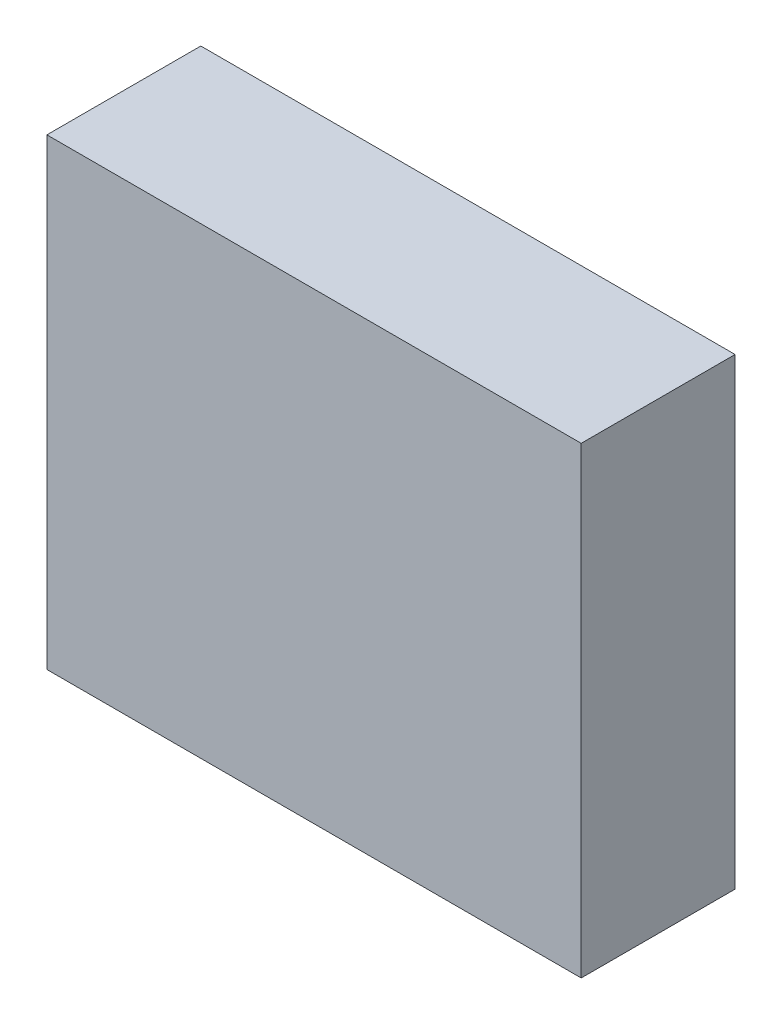
ISO-10303-21;
HEADER;
FILE_DESCRIPTION(('STEP AP214'),'2;1');
FILE_NAME('part.step','',(''),(''),'','','');
FILE_SCHEMA(('AUTOMOTIVE_DESIGN { 1 0 10303 214 1 1 1 1 }'));
ENDSEC;
DATA;
#1=APPLICATION_CONTEXT('core data for automotive mechanical design processes');
#2=APPLICATION_PROTOCOL_DEFINITION('international standard','automotive_design',2000,#1);
#3=PRODUCT_CONTEXT('',#1,'mechanical');
#4=PRODUCT('Part','Part','',(#3));
#5=PRODUCT_RELATED_PRODUCT_CATEGORY('part','',(#4));
#6=PRODUCT_DEFINITION_FORMATION('','',#4);
#7=PRODUCT_DEFINITION_CONTEXT('part definition',#1,'design');
#8=PRODUCT_DEFINITION('design','',#6,#7);
#9=PRODUCT_DEFINITION_SHAPE('','',#8);
#10=(LENGTH_UNIT() NAMED_UNIT(*) SI_UNIT(.MILLI.,.METRE.));
#11=(NAMED_UNIT(*) PLANE_ANGLE_UNIT() SI_UNIT($,.RADIAN.));
#12=(NAMED_UNIT(*) SI_UNIT($,.STERADIAN.) SOLID_ANGLE_UNIT());
#13=UNCERTAINTY_MEASURE_WITH_UNIT(LENGTH_MEASURE(1.E-05),#10,'distance_accuracy_value','');
#14=(GEOMETRIC_REPRESENTATION_CONTEXT(3) GLOBAL_UNCERTAINTY_ASSIGNED_CONTEXT((#13)) GLOBAL_UNIT_ASSIGNED_CONTEXT((#10,
#11,#12)) REPRESENTATION_CONTEXT('',''));
#15=CARTESIAN_POINT('',(0.,0.,0.));
#16=DIRECTION('',(0.,0.,1.));
#17=DIRECTION('',(1.,0.,0.));
#18=AXIS2_PLACEMENT_3D('',#15,#16,#17);
#19=CARTESIAN_POINT('',(-3.75000012,3.25000112,2.16000076));
#20=DIRECTION('',(0.,0.,1.));
#21=DIRECTION('',(1.,0.,0.));
#22=AXIS2_PLACEMENT_3D('',#19,#20,#21);
#23=PLANE('',#22);
#24=DIRECTION('',(0.,1.,0.));
#25=VECTOR('',#24,1.);
#26=CARTESIAN_POINT('',(3.75000012,3.25000112,2.16000076));
#27=LINE('',#26,#25);
#28=CARTESIAN_POINT('',(3.75000012,3.25000112,2.16000076));
#29=VERTEX_POINT('',#28);
#30=CARTESIAN_POINT('',(3.75000012,-3.25000112,2.16000076));
#31=VERTEX_POINT('',#30);
#32=EDGE_CURVE('E53',#29,#31,#27,.F.);
#33=ORIENTED_EDGE('',*,*,#32,.F.);
#34=DIRECTION('',(1.,0.,0.));
#35=VECTOR('',#34,1.);
#36=CARTESIAN_POINT('',(-3.75000012,3.25000112,2.16000076));
#37=LINE('',#36,#35);
#38=CARTESIAN_POINT('',(-3.75000012,3.25000112,2.16000076));
#39=VERTEX_POINT('',#38);
#40=EDGE_CURVE('E68',#39,#29,#37,.T.);
#41=ORIENTED_EDGE('',*,*,#40,.F.);
#42=DIRECTION('',(0.,1.,0.));
#43=VECTOR('',#42,1.);
#44=CARTESIAN_POINT('',(-3.75000012,-3.25000112,2.16000076));
#45=LINE('',#44,#43);
#46=CARTESIAN_POINT('',(-3.75000012,-3.25000112,2.16000076));
#47=VERTEX_POINT('',#46);
#48=EDGE_CURVE('E20',#47,#39,#45,.T.);
#49=ORIENTED_EDGE('',*,*,#48,.F.);
#50=DIRECTION('',(1.,0.,0.));
#51=VECTOR('',#50,1.);
#52=CARTESIAN_POINT('',(3.75000012,-3.25000112,2.16000076));
#53=LINE('',#52,#51);
#54=EDGE_CURVE('E58',#31,#47,#53,.F.);
#55=ORIENTED_EDGE('',*,*,#54,.F.);
#56=EDGE_LOOP('',(#33,#41,#49,#55));
#57=FACE_BOUND('',#56,.T.);
#58=ADVANCED_FACE('F17',(#57),#23,.T.);
#59=CARTESIAN_POINT('',(-3.75000012,-3.25000112,0.));
#60=DIRECTION('',(-1.,0.,0.));
#61=DIRECTION('',(0.,0.,1.));
#62=AXIS2_PLACEMENT_3D('',#59,#60,#61);
#63=PLANE('',#62);
#64=DIRECTION('',(0.,0.,1.));
#65=VECTOR('',#64,1.);
#66=CARTESIAN_POINT('',(-3.75000012,3.25000112,0.));
#67=LINE('',#66,#65);
#68=CARTESIAN_POINT('',(-3.75000012,3.25000112,0.));
#69=VERTEX_POINT('',#68);
#70=EDGE_CURVE('E79',#69,#39,#67,.T.);
#71=ORIENTED_EDGE('',*,*,#70,.F.);
#72=DIRECTION('',(0.,1.,0.));
#73=VECTOR('',#72,1.);
#74=CARTESIAN_POINT('',(-3.75000012,3.25000112,0.));
#75=LINE('',#74,#73);
#76=CARTESIAN_POINT('',(-3.75000012,-3.25000112,0.));
#77=VERTEX_POINT('',#76);
#78=EDGE_CURVE('E74',#69,#77,#75,.F.);
#79=ORIENTED_EDGE('',*,*,#78,.T.);
#80=DIRECTION('',(0.,0.,-1.));
#81=VECTOR('',#80,1.);
#82=CARTESIAN_POINT('',(-3.75000012,-3.25000112,0.));
#83=LINE('',#82,#81);
#84=EDGE_CURVE('E63',#47,#77,#83,.T.);
#85=ORIENTED_EDGE('',*,*,#84,.F.);
#86=ORIENTED_EDGE('',*,*,#48,.T.);
#87=EDGE_LOOP('',(#71,#79,#85,#86));
#88=FACE_BOUND('',#87,.T.);
#89=ADVANCED_FACE('F73',(#88),#63,.T.);
#90=CARTESIAN_POINT('',(3.75000012,-3.25000112,0.));
#91=DIRECTION('',(0.,-1.,0.));
#92=DIRECTION('',(0.,0.,-1.));
#93=AXIS2_PLACEMENT_3D('',#90,#91,#92);
#94=PLANE('',#93);
#95=ORIENTED_EDGE('',*,*,#84,.T.);
#96=DIRECTION('',(1.,0.,0.));
#97=VECTOR('',#96,1.);
#98=CARTESIAN_POINT('',(-3.75000012,-3.25000112,0.));
#99=LINE('',#98,#97);
#100=CARTESIAN_POINT('',(3.75000012,-3.25000112,0.));
#101=VERTEX_POINT('',#100);
#102=EDGE_CURVE('E84',#77,#101,#99,.T.);
#103=ORIENTED_EDGE('',*,*,#102,.T.);
#104=DIRECTION('',(0.,0.,-1.));
#105=VECTOR('',#104,1.);
#106=CARTESIAN_POINT('',(3.75000012,-3.25000112,0.));
#107=LINE('',#106,#105);
#108=EDGE_CURVE('E65',#31,#101,#107,.T.);
#109=ORIENTED_EDGE('',*,*,#108,.F.);
#110=ORIENTED_EDGE('',*,*,#54,.T.);
#111=EDGE_LOOP('',(#95,#103,#109,#110));
#112=FACE_BOUND('',#111,.T.);
#113=ADVANCED_FACE('F60',(#112),#94,.T.);
#114=CARTESIAN_POINT('',(3.75000012,3.25000112,0.));
#115=DIRECTION('',(1.,0.,0.));
#116=DIRECTION('',(0.,0.,-1.));
#117=AXIS2_PLACEMENT_3D('',#114,#115,#116);
#118=PLANE('',#117);
#119=ORIENTED_EDGE('',*,*,#108,.T.);
#120=DIRECTION('',(0.,1.,0.));
#121=VECTOR('',#120,1.);
#122=CARTESIAN_POINT('',(3.75000012,3.25000112,0.));
#123=LINE('',#122,#121);
#124=CARTESIAN_POINT('',(3.75000012,3.25000112,0.));
#125=VERTEX_POINT('',#124);
#126=EDGE_CURVE('E26',#101,#125,#123,.T.);
#127=ORIENTED_EDGE('',*,*,#126,.T.);
#128=DIRECTION('',(0.,0.,1.));
#129=VECTOR('',#128,1.);
#130=CARTESIAN_POINT('',(3.75000012,3.25000112,0.));
#131=LINE('',#130,#129);
#132=EDGE_CURVE('E34',#29,#125,#131,.F.);
#133=ORIENTED_EDGE('',*,*,#132,.F.);
#134=ORIENTED_EDGE('',*,*,#32,.T.);
#135=EDGE_LOOP('',(#119,#127,#133,#134));
#136=FACE_BOUND('',#135,.T.);
#137=ADVANCED_FACE('F88',(#136),#118,.T.);
#138=CARTESIAN_POINT('',(-3.75000012,3.25000112,0.));
#139=DIRECTION('',(0.,1.,0.));
#140=DIRECTION('',(0.,0.,1.));
#141=AXIS2_PLACEMENT_3D('',#138,#139,#140);
#142=PLANE('',#141);
#143=ORIENTED_EDGE('',*,*,#132,.T.);
#144=DIRECTION('',(1.,0.,0.));
#145=VECTOR('',#144,1.);
#146=CARTESIAN_POINT('',(-3.75000012,3.25000112,0.));
#147=LINE('',#146,#145);
#148=EDGE_CURVE('E11',#125,#69,#147,.F.);
#149=ORIENTED_EDGE('',*,*,#148,.T.);
#150=ORIENTED_EDGE('',*,*,#70,.T.);
#151=ORIENTED_EDGE('',*,*,#40,.T.);
#152=EDGE_LOOP('',(#143,#149,#150,#151));
#153=FACE_BOUND('',#152,.T.);
#154=ADVANCED_FACE('F91',(#153),#142,.T.);
#155=CARTESIAN_POINT('',(-3.75000012,3.25000112,0.));
#156=DIRECTION('',(0.,0.,1.));
#157=DIRECTION('',(1.,0.,0.));
#158=AXIS2_PLACEMENT_3D('',#155,#156,#157);
#159=PLANE('',#158);
#160=ORIENTED_EDGE('',*,*,#126,.F.);
#161=ORIENTED_EDGE('',*,*,#102,.F.);
#162=ORIENTED_EDGE('',*,*,#78,.F.);
#163=ORIENTED_EDGE('',*,*,#148,.F.);
#164=EDGE_LOOP('',(#160,#161,#162,#163));
#165=FACE_BOUND('',#164,.T.);
#166=ADVANCED_FACE('F90',(#165),#159,.F.);
#167=CLOSED_SHELL('',(#58,#89,#113,#137,#154,#166));
#168=MANIFOLD_SOLID_BREP('B1',#167);
#169=ADVANCED_BREP_SHAPE_REPRESENTATION('',(#18,#168),#14);
#170=SHAPE_DEFINITION_REPRESENTATION(#9,#169);
ENDSEC;
END-ISO-10303-21;
